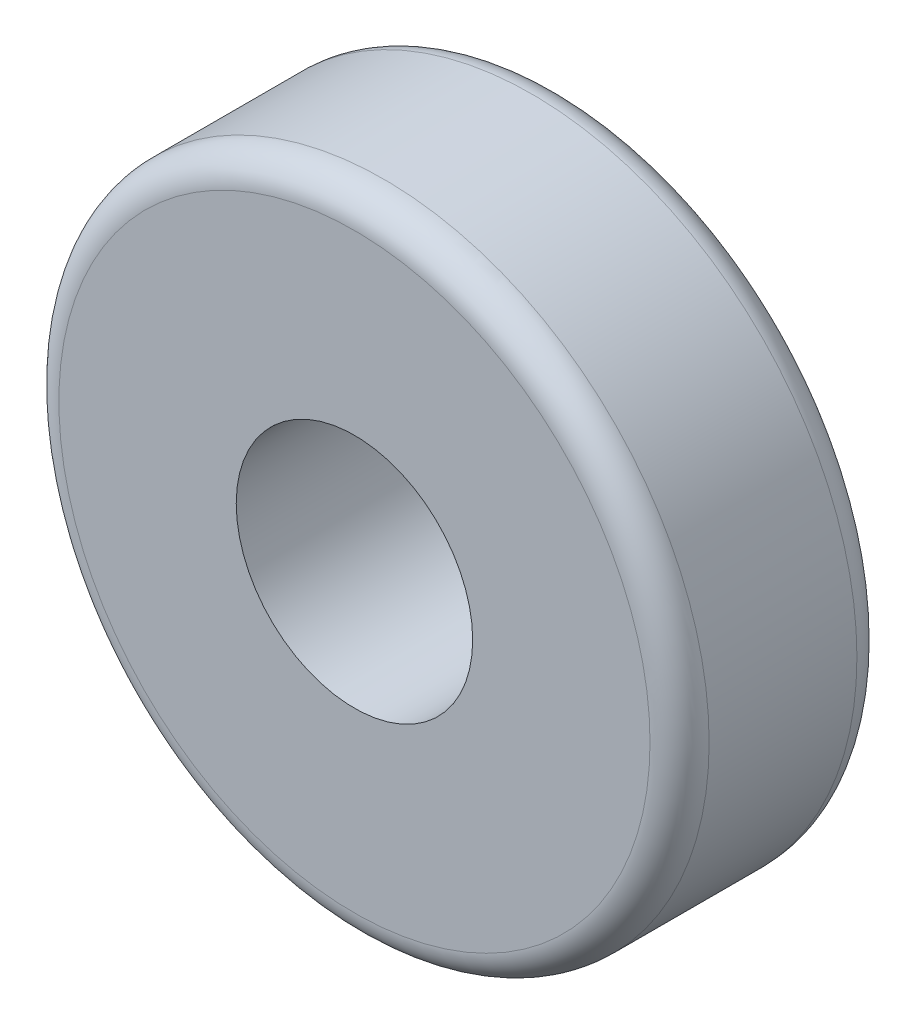
ISO-10303-21;
HEADER;
FILE_DESCRIPTION(('STEP AP214'),'2;1');
FILE_NAME('part.step','',(''),(''),'','','');
FILE_SCHEMA(('AUTOMOTIVE_DESIGN { 1 0 10303 214 1 1 1 1 }'));
ENDSEC;
DATA;
#1=APPLICATION_CONTEXT('core data for automotive mechanical design processes');
#2=APPLICATION_PROTOCOL_DEFINITION('international standard','automotive_design',2000,#1);
#3=PRODUCT_CONTEXT('',#1,'mechanical');
#4=PRODUCT('Part','Part','',(#3));
#5=PRODUCT_RELATED_PRODUCT_CATEGORY('part','',(#4));
#6=PRODUCT_DEFINITION_FORMATION('','',#4);
#7=PRODUCT_DEFINITION_CONTEXT('part definition',#1,'design');
#8=PRODUCT_DEFINITION('design','',#6,#7);
#9=PRODUCT_DEFINITION_SHAPE('','',#8);
#10=(LENGTH_UNIT() NAMED_UNIT(*) SI_UNIT(.MILLI.,.METRE.));
#11=(NAMED_UNIT(*) PLANE_ANGLE_UNIT() SI_UNIT($,.RADIAN.));
#12=(NAMED_UNIT(*) SI_UNIT($,.STERADIAN.) SOLID_ANGLE_UNIT());
#13=UNCERTAINTY_MEASURE_WITH_UNIT(LENGTH_MEASURE(1.E-05),#10,'distance_accuracy_value','');
#14=(GEOMETRIC_REPRESENTATION_CONTEXT(3) GLOBAL_UNCERTAINTY_ASSIGNED_CONTEXT((#13)) GLOBAL_UNIT_ASSIGNED_CONTEXT((#10,
#11,#12)) REPRESENTATION_CONTEXT('',''));
#15=CARTESIAN_POINT('',(0.,0.,0.));
#16=DIRECTION('',(0.,0.,1.));
#17=DIRECTION('',(1.,0.,0.));
#18=AXIS2_PLACEMENT_3D('',#15,#16,#17);
#19=CARTESIAN_POINT('',(0.,0.,7.));
#20=DIRECTION('',(0.,0.,1.));
#21=DIRECTION('',(1.,0.,0.));
#22=AXIS2_PLACEMENT_3D('',#19,#20,#21);
#23=PLANE('',#22);
#24=CARTESIAN_POINT('',(0.,0.,7.));
#25=DIRECTION('',(0.,0.,1.));
#26=DIRECTION('',(1.,0.,0.));
#27=AXIS2_PLACEMENT_3D('',#24,#25,#26);
#28=CIRCLE('',#27,10.);
#29=CARTESIAN_POINT('',(10.,0.,7.));
#30=VERTEX_POINT('',#29);
#31=EDGE_CURVE('E10',#30,#30,#28,.T.);
#32=ORIENTED_EDGE('',*,*,#31,.T.);
#33=EDGE_LOOP('',(#32));
#34=FACE_BOUND('',#33,.T.);
#35=CARTESIAN_POINT('',(0.,0.,7.));
#36=DIRECTION('',(0.,0.,1.));
#37=DIRECTION('',(1.,0.,0.));
#38=AXIS2_PLACEMENT_3D('',#35,#36,#37);
#39=CIRCLE('',#38,4.);
#40=CARTESIAN_POINT('',(4.,0.,7.));
#41=VERTEX_POINT('',#40);
#42=EDGE_CURVE('E50',#41,#41,#39,.T.);
#43=ORIENTED_EDGE('',*,*,#42,.F.);
#44=EDGE_LOOP('',(#43));
#45=FACE_BOUND('',#44,.T.);
#46=ADVANCED_FACE('F30',(#34,#45),#23,.T.);
#47=CARTESIAN_POINT('',(0.,0.,0.));
#48=DIRECTION('',(0.,0.,1.));
#49=DIRECTION('',(1.,0.,0.));
#50=AXIS2_PLACEMENT_3D('',#47,#48,#49);
#51=PLANE('',#50);
#52=CARTESIAN_POINT('',(0.,0.,0.));
#53=DIRECTION('',(0.,0.,1.));
#54=DIRECTION('',(1.,0.,0.));
#55=AXIS2_PLACEMENT_3D('',#52,#53,#54);
#56=CIRCLE('',#55,10.);
#57=CARTESIAN_POINT('',(10.,0.,0.));
#58=VERTEX_POINT('',#57);
#59=EDGE_CURVE('E37',#58,#58,#56,.F.);
#60=ORIENTED_EDGE('',*,*,#59,.T.);
#61=EDGE_LOOP('',(#60));
#62=FACE_BOUND('',#61,.T.);
#63=CARTESIAN_POINT('',(0.,0.,0.));
#64=DIRECTION('',(0.,0.,1.));
#65=DIRECTION('',(1.,0.,0.));
#66=AXIS2_PLACEMENT_3D('',#63,#64,#65);
#67=CIRCLE('',#66,4.);
#68=CARTESIAN_POINT('',(4.,0.,0.));
#69=VERTEX_POINT('',#68);
#70=EDGE_CURVE('E51',#69,#69,#67,.T.);
#71=ORIENTED_EDGE('',*,*,#70,.T.);
#72=EDGE_LOOP('',(#71));
#73=FACE_BOUND('',#72,.T.);
#74=ADVANCED_FACE('F61',(#62,#73),#51,.F.);
#75=CARTESIAN_POINT('',(0.,0.,7.));
#76=DIRECTION('',(0.,0.,-1.));
#77=DIRECTION('',(-1.,0.,0.));
#78=AXIS2_PLACEMENT_3D('',#75,#76,#77);
#79=CYLINDRICAL_SURFACE('',#78,11.);
#80=CARTESIAN_POINT('',(0.,0.,1.));
#81=DIRECTION('',(0.,0.,1.));
#82=DIRECTION('',(1.,0.,0.));
#83=AXIS2_PLACEMENT_3D('',#80,#81,#82);
#84=CIRCLE('',#83,11.);
#85=CARTESIAN_POINT('',(11.,0.,1.));
#86=VERTEX_POINT('',#85);
#87=EDGE_CURVE('E41',#86,#86,#84,.T.);
#88=ORIENTED_EDGE('',*,*,#87,.T.);
#89=EDGE_LOOP('',(#88));
#90=FACE_BOUND('',#89,.T.);
#91=CARTESIAN_POINT('',(0.,0.,6.));
#92=DIRECTION('',(0.,0.,1.));
#93=DIRECTION('',(1.,0.,0.));
#94=AXIS2_PLACEMENT_3D('',#91,#92,#93);
#95=CIRCLE('',#94,11.);
#96=CARTESIAN_POINT('',(11.,0.,6.));
#97=VERTEX_POINT('',#96);
#98=EDGE_CURVE('E45',#97,#97,#95,.F.);
#99=ORIENTED_EDGE('',*,*,#98,.T.);
#100=EDGE_LOOP('',(#99));
#101=FACE_BOUND('',#100,.T.);
#102=ADVANCED_FACE('F66',(#90,#101),#79,.T.);
#103=CARTESIAN_POINT('',(0.,0.,7.));
#104=DIRECTION('',(0.,0.,-1.));
#105=DIRECTION('',(-1.,0.,0.));
#106=AXIS2_PLACEMENT_3D('',#103,#104,#105);
#107=CYLINDRICAL_SURFACE('',#106,4.);
#108=ORIENTED_EDGE('',*,*,#42,.T.);
#109=EDGE_LOOP('',(#108));
#110=FACE_BOUND('',#109,.T.);
#111=ORIENTED_EDGE('',*,*,#70,.F.);
#112=EDGE_LOOP('',(#111));
#113=FACE_BOUND('',#112,.T.);
#114=ADVANCED_FACE('F57',(#110,#113),#107,.F.);
#115=CARTESIAN_POINT('',(0.,0.,1.));
#116=DIRECTION('',(0.,0.,1.));
#117=DIRECTION('',(1.,0.,0.));
#118=AXIS2_PLACEMENT_3D('',#115,#116,#117);
#119=TOROIDAL_SURFACE('',#118,10.,1.);
#120=ORIENTED_EDGE('',*,*,#59,.F.);
#121=EDGE_LOOP('',(#120));
#122=FACE_BOUND('',#121,.T.);
#123=ORIENTED_EDGE('',*,*,#87,.F.);
#124=EDGE_LOOP('',(#123));
#125=FACE_BOUND('',#124,.T.);
#126=ADVANCED_FACE('F72',(#122,#125),#119,.T.);
#127=CARTESIAN_POINT('',(0.,0.,6.));
#128=DIRECTION('',(0.,0.,1.));
#129=DIRECTION('',(1.,0.,0.));
#130=AXIS2_PLACEMENT_3D('',#127,#128,#129);
#131=TOROIDAL_SURFACE('',#130,10.,1.);
#132=ORIENTED_EDGE('',*,*,#98,.F.);
#133=EDGE_LOOP('',(#132));
#134=FACE_BOUND('',#133,.T.);
#135=ORIENTED_EDGE('',*,*,#31,.F.);
#136=EDGE_LOOP('',(#135));
#137=FACE_BOUND('',#136,.T.);
#138=ADVANCED_FACE('F32',(#134,#137),#131,.T.);
#139=CLOSED_SHELL('',(#46,#74,#102,#114,#126,#138));
#140=MANIFOLD_SOLID_BREP('B2',#139);
#141=ADVANCED_BREP_SHAPE_REPRESENTATION('',(#18,#140),#14);
#142=SHAPE_DEFINITION_REPRESENTATION(#9,#141);
ENDSEC;
END-ISO-10303-21;
